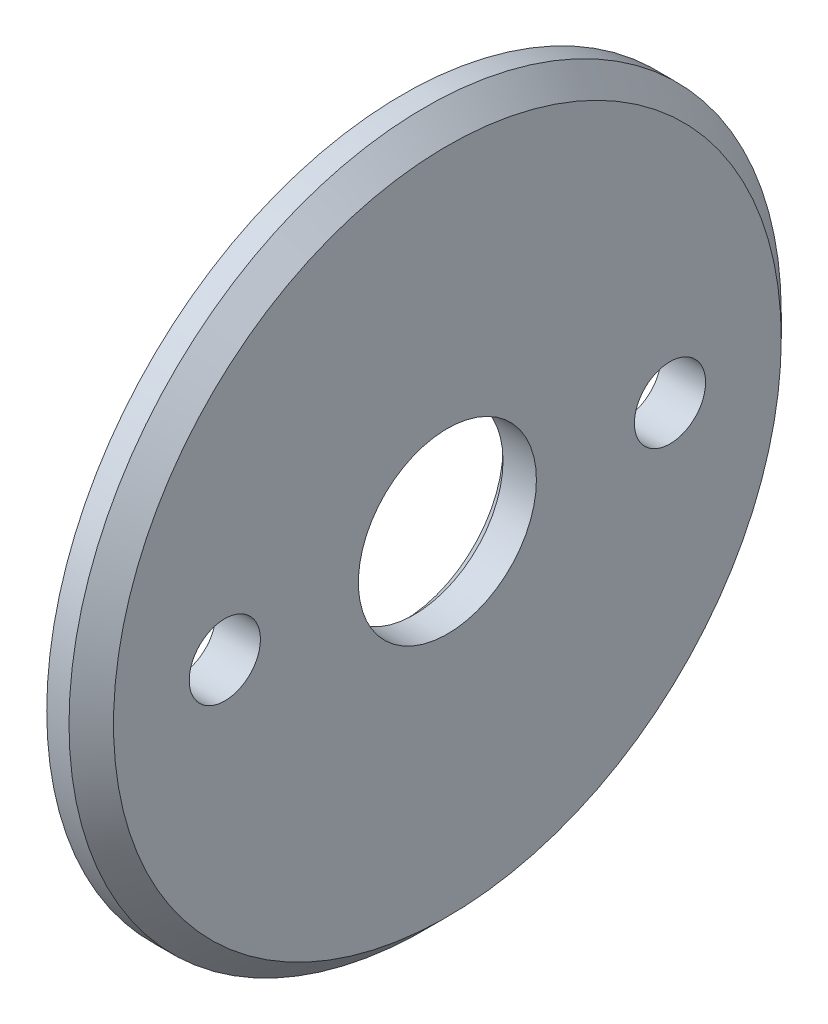
ISO-10303-21;
HEADER;
FILE_DESCRIPTION(('STEP AP214'),'2;1');
FILE_NAME('part.step','',(''),(''),'','','');
FILE_SCHEMA(('AUTOMOTIVE_DESIGN { 1 0 10303 214 1 1 1 1 }'));
ENDSEC;
DATA;
#1=APPLICATION_CONTEXT('core data for automotive mechanical design processes');
#2=APPLICATION_PROTOCOL_DEFINITION('international standard','automotive_design',2000,#1);
#3=PRODUCT_CONTEXT('',#1,'mechanical');
#4=PRODUCT('Part','Part','',(#3));
#5=PRODUCT_RELATED_PRODUCT_CATEGORY('part','',(#4));
#6=PRODUCT_DEFINITION_FORMATION('','',#4);
#7=PRODUCT_DEFINITION_CONTEXT('part definition',#1,'design');
#8=PRODUCT_DEFINITION('design','',#6,#7);
#9=PRODUCT_DEFINITION_SHAPE('','',#8);
#10=(LENGTH_UNIT() NAMED_UNIT(*) SI_UNIT(.MILLI.,.METRE.));
#11=(NAMED_UNIT(*) PLANE_ANGLE_UNIT() SI_UNIT($,.RADIAN.));
#12=(NAMED_UNIT(*) SI_UNIT($,.STERADIAN.) SOLID_ANGLE_UNIT());
#13=UNCERTAINTY_MEASURE_WITH_UNIT(LENGTH_MEASURE(1.E-05),#10,'distance_accuracy_value','');
#14=(GEOMETRIC_REPRESENTATION_CONTEXT(3) GLOBAL_UNCERTAINTY_ASSIGNED_CONTEXT((#13)) GLOBAL_UNIT_ASSIGNED_CONTEXT((#10,
#11,#12)) REPRESENTATION_CONTEXT('',''));
#15=CARTESIAN_POINT('',(0.,0.,0.));
#16=DIRECTION('',(0.,0.,1.));
#17=DIRECTION('',(1.,0.,0.));
#18=AXIS2_PLACEMENT_3D('',#15,#16,#17);
#19=CARTESIAN_POINT('',(2.,0.,0.));
#20=DIRECTION('',(1.,0.,0.));
#21=DIRECTION('',(0.,0.,-1.));
#22=AXIS2_PLACEMENT_3D('',#19,#20,#21);
#23=PLANE('',#22);
#24=CARTESIAN_POINT('',(2.,0.,0.));
#25=DIRECTION('',(1.,0.,0.));
#26=DIRECTION('',(0.,0.,-1.));
#27=AXIS2_PLACEMENT_3D('',#24,#25,#26);
#28=CIRCLE('',#27,15.);
#29=CARTESIAN_POINT('',(2.,0.,-15.));
#30=VERTEX_POINT('',#29);
#31=EDGE_CURVE('E46',#30,#30,#28,.T.);
#32=ORIENTED_EDGE('',*,*,#31,.T.);
#33=EDGE_LOOP('',(#32));
#34=FACE_BOUND('',#33,.T.);
#35=CARTESIAN_POINT('',(2.,0.,-10.));
#36=DIRECTION('',(1.,0.,0.));
#37=DIRECTION('',(0.,0.,-1.));
#38=AXIS2_PLACEMENT_3D('',#35,#36,#37);
#39=CIRCLE('',#38,1.6);
#40=CARTESIAN_POINT('',(2.,0.,-11.6));
#41=VERTEX_POINT('',#40);
#42=EDGE_CURVE('E64',#41,#41,#39,.T.);
#43=ORIENTED_EDGE('',*,*,#42,.F.);
#44=EDGE_LOOP('',(#43));
#45=FACE_BOUND('',#44,.T.);
#46=CARTESIAN_POINT('',(2.,0.,10.));
#47=DIRECTION('',(1.,0.,0.));
#48=DIRECTION('',(0.,0.,-1.));
#49=AXIS2_PLACEMENT_3D('',#46,#47,#48);
#50=CIRCLE('',#49,1.6);
#51=CARTESIAN_POINT('',(2.,0.,8.4));
#52=VERTEX_POINT('',#51);
#53=EDGE_CURVE('E58',#52,#52,#50,.T.);
#54=ORIENTED_EDGE('',*,*,#53,.F.);
#55=EDGE_LOOP('',(#54));
#56=FACE_BOUND('',#55,.T.);
#57=CARTESIAN_POINT('',(2.,0.,0.));
#58=DIRECTION('',(1.,0.,0.));
#59=DIRECTION('',(0.,0.,-1.));
#60=AXIS2_PLACEMENT_3D('',#57,#58,#59);
#61=CIRCLE('',#60,4.);
#62=CARTESIAN_POINT('',(2.,0.,-4.));
#63=VERTEX_POINT('',#62);
#64=EDGE_CURVE('E54',#63,#63,#61,.T.);
#65=ORIENTED_EDGE('',*,*,#64,.F.);
#66=EDGE_LOOP('',(#65));
#67=FACE_BOUND('',#66,.T.);
#68=ADVANCED_FACE('F31',(#34,#45,#56,#67),#23,.T.);
#69=CARTESIAN_POINT('',(0.,0.,0.));
#70=DIRECTION('',(1.,0.,0.));
#71=DIRECTION('',(0.,0.,-1.));
#72=AXIS2_PLACEMENT_3D('',#69,#70,#71);
#73=PLANE('',#72);
#74=CARTESIAN_POINT('',(0.,0.,0.));
#75=DIRECTION('',(1.,0.,0.));
#76=DIRECTION('',(0.,0.,-1.));
#77=AXIS2_PLACEMENT_3D('',#74,#75,#76);
#78=CIRCLE('',#77,4.5);
#79=CARTESIAN_POINT('',(0.,0.,-4.5));
#80=VERTEX_POINT('',#79);
#81=EDGE_CURVE('E38',#80,#80,#78,.T.);
#82=ORIENTED_EDGE('',*,*,#81,.T.);
#83=EDGE_LOOP('',(#82));
#84=FACE_BOUND('',#83,.T.);
#85=CARTESIAN_POINT('',(0.,0.,-10.));
#86=DIRECTION('',(1.,0.,0.));
#87=DIRECTION('',(0.,0.,-1.));
#88=AXIS2_PLACEMENT_3D('',#85,#86,#87);
#89=CIRCLE('',#88,1.6);
#90=CARTESIAN_POINT('',(0.,0.,-11.6));
#91=VERTEX_POINT('',#90);
#92=EDGE_CURVE('E61',#91,#91,#89,.T.);
#93=ORIENTED_EDGE('',*,*,#92,.T.);
#94=EDGE_LOOP('',(#93));
#95=FACE_BOUND('',#94,.T.);
#96=CARTESIAN_POINT('',(0.,0.,10.));
#97=DIRECTION('',(1.,0.,0.));
#98=DIRECTION('',(0.,0.,-1.));
#99=AXIS2_PLACEMENT_3D('',#96,#97,#98);
#100=CIRCLE('',#99,1.6);
#101=CARTESIAN_POINT('',(0.,0.,8.4));
#102=VERTEX_POINT('',#101);
#103=EDGE_CURVE('E57',#102,#102,#100,.T.);
#104=ORIENTED_EDGE('',*,*,#103,.T.);
#105=EDGE_LOOP('',(#104));
#106=FACE_BOUND('',#105,.T.);
#107=CARTESIAN_POINT('',(0.,0.,0.));
#108=DIRECTION('',(1.,0.,0.));
#109=DIRECTION('',(0.,0.,-1.));
#110=AXIS2_PLACEMENT_3D('',#107,#108,#109);
#111=CIRCLE('',#110,16.);
#112=CARTESIAN_POINT('',(0.,0.,-16.));
#113=VERTEX_POINT('',#112);
#114=EDGE_CURVE('E51',#113,#113,#111,.T.);
#115=ORIENTED_EDGE('',*,*,#114,.F.);
#116=EDGE_LOOP('',(#115));
#117=FACE_BOUND('',#116,.T.);
#118=ADVANCED_FACE('F70',(#84,#95,#106,#117),#73,.F.);
#119=CARTESIAN_POINT('',(2.,0.,0.));
#120=DIRECTION('',(-1.,0.,0.));
#121=DIRECTION('',(0.,0.,1.));
#122=AXIS2_PLACEMENT_3D('',#119,#120,#121);
#123=CYLINDRICAL_SURFACE('',#122,16.);
#124=CARTESIAN_POINT('',(0.999999999999985,0.,0.));
#125=DIRECTION('',(1.,0.,0.));
#126=DIRECTION('',(0.,0.,-1.));
#127=AXIS2_PLACEMENT_3D('',#124,#125,#126);
#128=CIRCLE('',#127,16.);
#129=CARTESIAN_POINT('',(0.999999999999985,0.,-16.));
#130=VERTEX_POINT('',#129);
#131=EDGE_CURVE('E42',#130,#130,#128,.F.);
#132=ORIENTED_EDGE('',*,*,#131,.T.);
#133=EDGE_LOOP('',(#132));
#134=FACE_BOUND('',#133,.T.);
#135=ORIENTED_EDGE('',*,*,#114,.T.);
#136=EDGE_LOOP('',(#135));
#137=FACE_BOUND('',#136,.T.);
#138=ADVANCED_FACE('F91',(#134,#137),#123,.T.);
#139=CARTESIAN_POINT('',(2.,0.,0.));
#140=DIRECTION('',(-1.,0.,0.));
#141=DIRECTION('',(0.,0.,1.));
#142=AXIS2_PLACEMENT_3D('',#139,#140,#141);
#143=CYLINDRICAL_SURFACE('',#142,4.);
#144=CARTESIAN_POINT('',(0.500000000000004,0.,0.));
#145=DIRECTION('',(1.,0.,0.));
#146=DIRECTION('',(0.,0.,-1.));
#147=AXIS2_PLACEMENT_3D('',#144,#145,#146);
#148=CIRCLE('',#147,4.);
#149=CARTESIAN_POINT('',(0.500000000000004,0.,-4.));
#150=VERTEX_POINT('',#149);
#151=EDGE_CURVE('E10',#150,#150,#148,.F.);
#152=ORIENTED_EDGE('',*,*,#151,.T.);
#153=EDGE_LOOP('',(#152));
#154=FACE_BOUND('',#153,.T.);
#155=ORIENTED_EDGE('',*,*,#64,.T.);
#156=EDGE_LOOP('',(#155));
#157=FACE_BOUND('',#156,.T.);
#158=ADVANCED_FACE('F89',(#154,#157),#143,.F.);
#159=CARTESIAN_POINT('',(0.,0.,10.));
#160=DIRECTION('',(1.,0.,0.));
#161=DIRECTION('',(0.,0.,-1.));
#162=AXIS2_PLACEMENT_3D('',#159,#160,#161);
#163=CYLINDRICAL_SURFACE('',#162,1.6);
#164=ORIENTED_EDGE('',*,*,#103,.F.);
#165=EDGE_LOOP('',(#164));
#166=FACE_BOUND('',#165,.T.);
#167=ORIENTED_EDGE('',*,*,#53,.T.);
#168=EDGE_LOOP('',(#167));
#169=FACE_BOUND('',#168,.T.);
#170=ADVANCED_FACE('F77',(#166,#169),#163,.F.);
#171=CARTESIAN_POINT('',(0.,0.,-10.));
#172=DIRECTION('',(1.,0.,0.));
#173=DIRECTION('',(0.,0.,-1.));
#174=AXIS2_PLACEMENT_3D('',#171,#172,#173);
#175=CYLINDRICAL_SURFACE('',#174,1.6);
#176=ORIENTED_EDGE('',*,*,#92,.F.);
#177=EDGE_LOOP('',(#176));
#178=FACE_BOUND('',#177,.T.);
#179=ORIENTED_EDGE('',*,*,#42,.T.);
#180=EDGE_LOOP('',(#179));
#181=FACE_BOUND('',#180,.T.);
#182=ADVANCED_FACE('F73',(#178,#181),#175,.F.);
#183=CARTESIAN_POINT('',(2.,0.,0.));
#184=DIRECTION('',(-1.,0.,0.));
#185=DIRECTION('',(0.,0.,1.));
#186=AXIS2_PLACEMENT_3D('',#183,#184,#185);
#187=CONICAL_SURFACE('',#186,15.,0.785398163397448);
#188=ORIENTED_EDGE('',*,*,#131,.F.);
#189=EDGE_LOOP('',(#188));
#190=FACE_BOUND('',#189,.T.);
#191=ORIENTED_EDGE('',*,*,#31,.F.);
#192=EDGE_LOOP('',(#191));
#193=FACE_BOUND('',#192,.T.);
#194=ADVANCED_FACE('F76',(#190,#193),#187,.T.);
#195=CARTESIAN_POINT('',(0.,0.,0.));
#196=DIRECTION('',(-1.,0.,0.));
#197=DIRECTION('',(0.,0.,1.));
#198=AXIS2_PLACEMENT_3D('',#195,#196,#197);
#199=CONICAL_SURFACE('',#198,4.5,0.785398163397448);
#200=ORIENTED_EDGE('',*,*,#151,.F.);
#201=EDGE_LOOP('',(#200));
#202=FACE_BOUND('',#201,.T.);
#203=ORIENTED_EDGE('',*,*,#81,.F.);
#204=EDGE_LOOP('',(#203));
#205=FACE_BOUND('',#204,.T.);
#206=ADVANCED_FACE('F33',(#202,#205),#199,.F.);
#207=CLOSED_SHELL('',(#68,#118,#138,#158,#170,#182,#194,#206));
#208=MANIFOLD_SOLID_BREP('B2',#207);
#209=ADVANCED_BREP_SHAPE_REPRESENTATION('',(#18,#208),#14);
#210=SHAPE_DEFINITION_REPRESENTATION(#9,#209);
ENDSEC;
END-ISO-10303-21;
